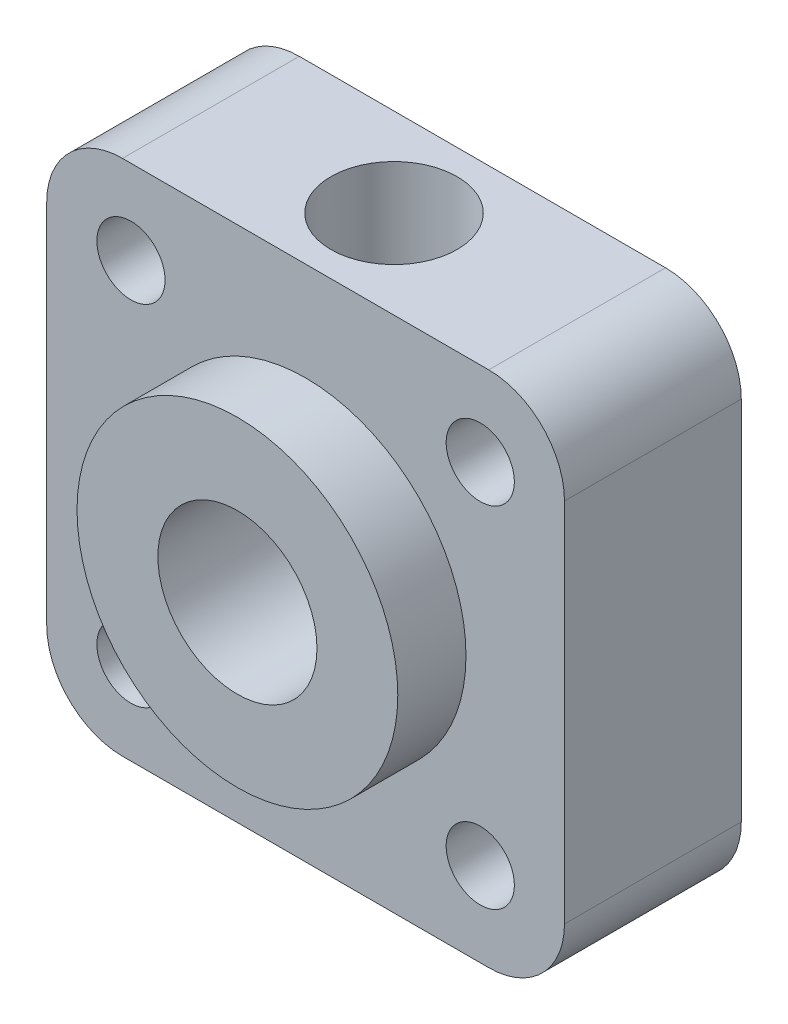
ISO-10303-21;
HEADER;
FILE_DESCRIPTION(('STEP AP214'),'2;1');
FILE_NAME('part.step','',(''),(''),'','','');
FILE_SCHEMA(('AUTOMOTIVE_DESIGN { 1 0 10303 214 1 1 1 1 }'));
ENDSEC;
DATA;
#1=APPLICATION_CONTEXT('core data for automotive mechanical design processes');
#2=APPLICATION_PROTOCOL_DEFINITION('international standard','automotive_design',2000,#1);
#3=PRODUCT_CONTEXT('',#1,'mechanical');
#4=PRODUCT('Part','Part','',(#3));
#5=PRODUCT_RELATED_PRODUCT_CATEGORY('part','',(#4));
#6=PRODUCT_DEFINITION_FORMATION('','',#4);
#7=PRODUCT_DEFINITION_CONTEXT('part definition',#1,'design');
#8=PRODUCT_DEFINITION('design','',#6,#7);
#9=PRODUCT_DEFINITION_SHAPE('','',#8);
#10=(LENGTH_UNIT() NAMED_UNIT(*) SI_UNIT(.MILLI.,.METRE.));
#11=(NAMED_UNIT(*) PLANE_ANGLE_UNIT() SI_UNIT($,.RADIAN.));
#12=(NAMED_UNIT(*) SI_UNIT($,.STERADIAN.) SOLID_ANGLE_UNIT());
#13=UNCERTAINTY_MEASURE_WITH_UNIT(LENGTH_MEASURE(1.E-05),#10,'distance_accuracy_value','');
#14=(GEOMETRIC_REPRESENTATION_CONTEXT(3) GLOBAL_UNCERTAINTY_ASSIGNED_CONTEXT((#13)) GLOBAL_UNIT_ASSIGNED_CONTEXT((#10,
#11,#12)) REPRESENTATION_CONTEXT('',''));
#15=CARTESIAN_POINT('',(0.,0.,0.));
#16=DIRECTION('',(0.,0.,1.));
#17=DIRECTION('',(1.,0.,0.));
#18=AXIS2_PLACEMENT_3D('',#15,#16,#17);
#19=CARTESIAN_POINT('',(0.,0.,7.));
#20=DIRECTION('',(0.,0.,1.));
#21=DIRECTION('',(1.,0.,0.));
#22=AXIS2_PLACEMENT_3D('',#19,#20,#21);
#23=PLANE('',#22);
#24=CARTESIAN_POINT('',(-6.91550432000444,-6.91550432000443,7.));
#25=DIRECTION('',(0.,0.,1.));
#26=DIRECTION('',(1.,0.,0.));
#27=AXIS2_PLACEMENT_3D('',#24,#25,#26);
#28=CIRCLE('',#27,1.35);
#29=CARTESIAN_POINT('',(-5.56550432000444,-6.91550432000443,7.));
#30=VERTEX_POINT('',#29);
#31=EDGE_CURVE('E202',#30,#30,#28,.T.);
#32=ORIENTED_EDGE('',*,*,#31,.F.);
#33=EDGE_LOOP('',(#32));
#34=FACE_BOUND('',#33,.T.);
#35=CARTESIAN_POINT('',(6.91550432000443,-6.91550432000443,7.));
#36=DIRECTION('',(0.,0.,1.));
#37=DIRECTION('',(1.,0.,0.));
#38=AXIS2_PLACEMENT_3D('',#35,#36,#37);
#39=CIRCLE('',#38,1.35);
#40=CARTESIAN_POINT('',(8.26550432000443,-6.91550432000443,7.));
#41=VERTEX_POINT('',#40);
#42=EDGE_CURVE('E196',#41,#41,#39,.T.);
#43=ORIENTED_EDGE('',*,*,#42,.F.);
#44=EDGE_LOOP('',(#43));
#45=FACE_BOUND('',#44,.T.);
#46=CARTESIAN_POINT('',(6.91550432000443,6.91550432000444,7.));
#47=DIRECTION('',(0.,0.,1.));
#48=DIRECTION('',(1.,0.,0.));
#49=AXIS2_PLACEMENT_3D('',#46,#47,#48);
#50=CIRCLE('',#49,1.35);
#51=CARTESIAN_POINT('',(8.26550432000443,6.91550432000444,7.));
#52=VERTEX_POINT('',#51);
#53=EDGE_CURVE('E190',#52,#52,#50,.T.);
#54=ORIENTED_EDGE('',*,*,#53,.F.);
#55=EDGE_LOOP('',(#54));
#56=FACE_BOUND('',#55,.T.);
#57=CARTESIAN_POINT('',(-6.91550432000444,6.91550432000443,7.));
#58=DIRECTION('',(0.,0.,1.));
#59=DIRECTION('',(1.,0.,0.));
#60=AXIS2_PLACEMENT_3D('',#57,#58,#59);
#61=CIRCLE('',#60,1.35000000000001);
#62=CARTESIAN_POINT('',(-5.56550432000443,6.91550432000443,7.));
#63=VERTEX_POINT('',#62);
#64=EDGE_CURVE('E184',#63,#63,#61,.T.);
#65=ORIENTED_EDGE('',*,*,#64,.F.);
#66=EDGE_LOOP('',(#65));
#67=FACE_BOUND('',#66,.T.);
#68=DIRECTION('',(0.,-1.,0.));
#69=VECTOR('',#68,1.);
#70=CARTESIAN_POINT('',(-10.25,10.25,7.));
#71=LINE('',#70,#69);
#72=CARTESIAN_POINT('',(-10.25,7.25000000000001,7.));
#73=VERTEX_POINT('',#72);
#74=CARTESIAN_POINT('',(-10.25,-7.24999999999999,7.));
#75=VERTEX_POINT('',#74);
#76=EDGE_CURVE('E171',#73,#75,#71,.T.);
#77=ORIENTED_EDGE('',*,*,#76,.T.);
#78=CARTESIAN_POINT('',(-7.25000000000001,-7.25,7.));
#79=DIRECTION('',(0.,0.,1.));
#80=DIRECTION('',(1.,0.,0.));
#81=AXIS2_PLACEMENT_3D('',#78,#79,#80);
#82=CIRCLE('',#81,3.);
#83=CARTESIAN_POINT('',(-7.25000000000001,-10.25,7.));
#84=VERTEX_POINT('',#83);
#85=EDGE_CURVE('E148',#75,#84,#82,.T.);
#86=ORIENTED_EDGE('',*,*,#85,.T.);
#87=DIRECTION('',(1.,0.,0.));
#88=VECTOR('',#87,1.);
#89=CARTESIAN_POINT('',(-10.25,-10.25,7.));
#90=LINE('',#89,#88);
#91=CARTESIAN_POINT('',(7.24999999999999,-10.25,7.));
#92=VERTEX_POINT('',#91);
#93=EDGE_CURVE('E120',#84,#92,#90,.T.);
#94=ORIENTED_EDGE('',*,*,#93,.T.);
#95=CARTESIAN_POINT('',(7.25,-7.24999999999999,7.));
#96=DIRECTION('',(0.,0.,1.));
#97=DIRECTION('',(1.,0.,0.));
#98=AXIS2_PLACEMENT_3D('',#95,#96,#97);
#99=CIRCLE('',#98,3.);
#100=CARTESIAN_POINT('',(10.25,-7.24999999999999,7.));
#101=VERTEX_POINT('',#100);
#102=EDGE_CURVE('E146',#92,#101,#99,.T.);
#103=ORIENTED_EDGE('',*,*,#102,.T.);
#104=DIRECTION('',(0.,1.,0.));
#105=VECTOR('',#104,1.);
#106=CARTESIAN_POINT('',(10.25,10.25,7.));
#107=LINE('',#106,#105);
#108=CARTESIAN_POINT('',(10.25,7.25000000000001,7.));
#109=VERTEX_POINT('',#108);
#110=EDGE_CURVE('E126',#101,#109,#107,.T.);
#111=ORIENTED_EDGE('',*,*,#110,.T.);
#112=CARTESIAN_POINT('',(7.24999999999999,7.25000000000001,7.));
#113=DIRECTION('',(0.,0.,1.));
#114=DIRECTION('',(1.,0.,0.));
#115=AXIS2_PLACEMENT_3D('',#112,#113,#114);
#116=CIRCLE('',#115,3.);
#117=CARTESIAN_POINT('',(7.24999999999999,10.25,7.));
#118=VERTEX_POINT('',#117);
#119=EDGE_CURVE('E55',#109,#118,#116,.T.);
#120=ORIENTED_EDGE('',*,*,#119,.T.);
#121=DIRECTION('',(-1.,0.,0.));
#122=VECTOR('',#121,1.);
#123=CARTESIAN_POINT('',(-10.25,10.25,7.));
#124=LINE('',#123,#122);
#125=CARTESIAN_POINT('',(-7.25000000000001,10.25,7.));
#126=VERTEX_POINT('',#125);
#127=EDGE_CURVE('E129',#118,#126,#124,.T.);
#128=ORIENTED_EDGE('',*,*,#127,.T.);
#129=CARTESIAN_POINT('',(-7.25000000000001,7.25000000000001,7.));
#130=DIRECTION('',(0.,0.,1.));
#131=DIRECTION('',(1.,0.,0.));
#132=AXIS2_PLACEMENT_3D('',#129,#130,#131);
#133=CIRCLE('',#132,3.);
#134=EDGE_CURVE('E143',#126,#73,#133,.T.);
#135=ORIENTED_EDGE('',*,*,#134,.T.);
#136=EDGE_LOOP('',(#77,#86,#94,#103,#111,#120,#128,#135));
#137=FACE_BOUND('',#136,.T.);
#138=CARTESIAN_POINT('',(0.,0.,7.));
#139=DIRECTION('',(0.,0.,1.));
#140=DIRECTION('',(1.,0.,0.));
#141=AXIS2_PLACEMENT_3D('',#138,#139,#140);
#142=CIRCLE('',#141,6.35);
#143=CARTESIAN_POINT('',(6.35,0.,7.));
#144=VERTEX_POINT('',#143);
#145=EDGE_CURVE('E167',#144,#144,#142,.T.);
#146=ORIENTED_EDGE('',*,*,#145,.F.);
#147=EDGE_LOOP('',(#146));
#148=FACE_BOUND('',#147,.T.);
#149=ADVANCED_FACE('F34',(#34,#45,#56,#67,#137,#148),#23,.T.);
#150=CARTESIAN_POINT('',(10.25,10.25,7.));
#151=DIRECTION('',(-1.,0.,0.));
#152=DIRECTION('',(0.,-1.,0.));
#153=AXIS2_PLACEMENT_3D('',#150,#151,#152);
#154=PLANE('',#153);
#155=ORIENTED_EDGE('',*,*,#110,.F.);
#156=DIRECTION('',(0.,0.,-1.));
#157=VECTOR('',#156,1.);
#158=CARTESIAN_POINT('',(10.25,-7.24999999999999,7.));
#159=LINE('',#158,#157);
#160=CARTESIAN_POINT('',(10.25,-7.24999999999999,0.));
#161=VERTEX_POINT('',#160);
#162=EDGE_CURVE('E152',#101,#161,#159,.T.);
#163=ORIENTED_EDGE('',*,*,#162,.T.);
#164=DIRECTION('',(0.,1.,0.));
#165=VECTOR('',#164,1.);
#166=CARTESIAN_POINT('',(10.25,10.25,0.));
#167=LINE('',#166,#165);
#168=CARTESIAN_POINT('',(10.25,7.25000000000001,0.));
#169=VERTEX_POINT('',#168);
#170=EDGE_CURVE('E159',#161,#169,#167,.T.);
#171=ORIENTED_EDGE('',*,*,#170,.T.);
#172=DIRECTION('',(0.,0.,-1.));
#173=VECTOR('',#172,1.);
#174=CARTESIAN_POINT('',(10.25,7.25000000000001,7.));
#175=LINE('',#174,#173);
#176=EDGE_CURVE('E150',#169,#109,#175,.F.);
#177=ORIENTED_EDGE('',*,*,#176,.T.);
#178=EDGE_LOOP('',(#155,#163,#171,#177));
#179=FACE_BOUND('',#178,.T.);
#180=ADVANCED_FACE('F158',(#179),#154,.F.);
#181=CARTESIAN_POINT('',(-10.25,10.25,7.));
#182=DIRECTION('',(0.,-1.,0.));
#183=DIRECTION('',(0.,0.,-1.));
#184=AXIS2_PLACEMENT_3D('',#181,#182,#183);
#185=PLANE('',#184);
#186=CARTESIAN_POINT('',(0.,10.25,3.5));
#187=DIRECTION('',(0.,1.,0.));
#188=DIRECTION('',(0.,0.,1.));
#189=AXIS2_PLACEMENT_3D('',#186,#187,#188);
#190=CIRCLE('',#189,2.5);
#191=CARTESIAN_POINT('',(0.,10.25,6.));
#192=VERTEX_POINT('',#191);
#193=EDGE_CURVE('E205',#192,#192,#190,.T.);
#194=ORIENTED_EDGE('',*,*,#193,.F.);
#195=EDGE_LOOP('',(#194));
#196=FACE_BOUND('',#195,.T.);
#197=ORIENTED_EDGE('',*,*,#127,.F.);
#198=DIRECTION('',(0.,0.,-1.));
#199=VECTOR('',#198,1.);
#200=CARTESIAN_POINT('',(7.24999999999999,10.25,7.));
#201=LINE('',#200,#199);
#202=CARTESIAN_POINT('',(7.24999999999999,10.25,0.));
#203=VERTEX_POINT('',#202);
#204=EDGE_CURVE('E11',#118,#203,#201,.T.);
#205=ORIENTED_EDGE('',*,*,#204,.T.);
#206=DIRECTION('',(-1.,0.,0.));
#207=VECTOR('',#206,1.);
#208=CARTESIAN_POINT('',(-10.25,10.25,0.));
#209=LINE('',#208,#207);
#210=CARTESIAN_POINT('',(-7.25000000000001,10.25,0.));
#211=VERTEX_POINT('',#210);
#212=EDGE_CURVE('E131',#203,#211,#209,.T.);
#213=ORIENTED_EDGE('',*,*,#212,.T.);
#214=DIRECTION('',(0.,0.,-1.));
#215=VECTOR('',#214,1.);
#216=CARTESIAN_POINT('',(-7.25000000000001,10.25,7.));
#217=LINE('',#216,#215);
#218=EDGE_CURVE('E42',#211,#126,#217,.F.);
#219=ORIENTED_EDGE('',*,*,#218,.T.);
#220=EDGE_LOOP('',(#197,#205,#213,#219));
#221=FACE_BOUND('',#220,.T.);
#222=ADVANCED_FACE('F261',(#196,#221),#185,.F.);
#223=CARTESIAN_POINT('',(-10.25,10.25,7.));
#224=DIRECTION('',(1.,0.,0.));
#225=DIRECTION('',(0.,1.,0.));
#226=AXIS2_PLACEMENT_3D('',#223,#224,#225);
#227=PLANE('',#226);
#228=DIRECTION('',(0.,-1.,0.));
#229=VECTOR('',#228,1.);
#230=CARTESIAN_POINT('',(-10.25,10.25,0.));
#231=LINE('',#230,#229);
#232=CARTESIAN_POINT('',(-10.25,7.25000000000001,0.));
#233=VERTEX_POINT('',#232);
#234=CARTESIAN_POINT('',(-10.25,-7.24999999999999,0.));
#235=VERTEX_POINT('',#234);
#236=EDGE_CURVE('E127',#233,#235,#231,.T.);
#237=ORIENTED_EDGE('',*,*,#236,.T.);
#238=DIRECTION('',(0.,0.,-1.));
#239=VECTOR('',#238,1.);
#240=CARTESIAN_POINT('',(-10.25,-7.25,7.));
#241=LINE('',#240,#239);
#242=EDGE_CURVE('E105',#235,#75,#241,.F.);
#243=ORIENTED_EDGE('',*,*,#242,.T.);
#244=ORIENTED_EDGE('',*,*,#76,.F.);
#245=DIRECTION('',(0.,0.,-1.));
#246=VECTOR('',#245,1.);
#247=CARTESIAN_POINT('',(-10.25,7.25000000000001,7.));
#248=LINE('',#247,#246);
#249=EDGE_CURVE('E110',#73,#233,#248,.T.);
#250=ORIENTED_EDGE('',*,*,#249,.T.);
#251=EDGE_LOOP('',(#237,#243,#244,#250));
#252=FACE_BOUND('',#251,.T.);
#253=ADVANCED_FACE('F258',(#252),#227,.F.);
#254=CARTESIAN_POINT('',(-10.25,-10.25,7.));
#255=DIRECTION('',(0.,1.,0.));
#256=DIRECTION('',(0.,0.,1.));
#257=AXIS2_PLACEMENT_3D('',#254,#255,#256);
#258=PLANE('',#257);
#259=ORIENTED_EDGE('',*,*,#93,.F.);
#260=DIRECTION('',(0.,0.,-1.));
#261=VECTOR('',#260,1.);
#262=CARTESIAN_POINT('',(-7.25000000000001,-10.25,7.));
#263=LINE('',#262,#261);
#264=CARTESIAN_POINT('',(-7.25000000000001,-10.25,0.));
#265=VERTEX_POINT('',#264);
#266=EDGE_CURVE('E104',#84,#265,#263,.T.);
#267=ORIENTED_EDGE('',*,*,#266,.T.);
#268=DIRECTION('',(1.,0.,0.));
#269=VECTOR('',#268,1.);
#270=CARTESIAN_POINT('',(-10.25,-10.25,0.));
#271=LINE('',#270,#269);
#272=CARTESIAN_POINT('',(7.24999999999999,-10.25,0.));
#273=VERTEX_POINT('',#272);
#274=EDGE_CURVE('E117',#265,#273,#271,.T.);
#275=ORIENTED_EDGE('',*,*,#274,.T.);
#276=DIRECTION('',(0.,0.,-1.));
#277=VECTOR('',#276,1.);
#278=CARTESIAN_POINT('',(7.25,-10.25,7.));
#279=LINE('',#278,#277);
#280=EDGE_CURVE('E122',#273,#92,#279,.F.);
#281=ORIENTED_EDGE('',*,*,#280,.T.);
#282=EDGE_LOOP('',(#259,#267,#275,#281));
#283=FACE_BOUND('',#282,.T.);
#284=ADVANCED_FACE('F116',(#283),#258,.F.);
#285=CARTESIAN_POINT('',(0.,0.,0.));
#286=DIRECTION('',(0.,0.,1.));
#287=DIRECTION('',(1.,0.,0.));
#288=AXIS2_PLACEMENT_3D('',#285,#286,#287);
#289=PLANE('',#288);
#290=CARTESIAN_POINT('',(-6.91550432000444,-6.91550432000443,0.));
#291=DIRECTION('',(0.,0.,1.));
#292=DIRECTION('',(1.,0.,0.));
#293=AXIS2_PLACEMENT_3D('',#290,#291,#292);
#294=CIRCLE('',#293,1.35);
#295=CARTESIAN_POINT('',(-5.56550432000444,-6.91550432000443,0.));
#296=VERTEX_POINT('',#295);
#297=EDGE_CURVE('E199',#296,#296,#294,.T.);
#298=ORIENTED_EDGE('',*,*,#297,.T.);
#299=EDGE_LOOP('',(#298));
#300=FACE_BOUND('',#299,.T.);
#301=CARTESIAN_POINT('',(6.91550432000443,-6.91550432000443,0.));
#302=DIRECTION('',(0.,0.,1.));
#303=DIRECTION('',(1.,0.,0.));
#304=AXIS2_PLACEMENT_3D('',#301,#302,#303);
#305=CIRCLE('',#304,1.35);
#306=CARTESIAN_POINT('',(8.26550432000443,-6.91550432000443,0.));
#307=VERTEX_POINT('',#306);
#308=EDGE_CURVE('E193',#307,#307,#305,.T.);
#309=ORIENTED_EDGE('',*,*,#308,.T.);
#310=EDGE_LOOP('',(#309));
#311=FACE_BOUND('',#310,.T.);
#312=CARTESIAN_POINT('',(6.91550432000443,6.91550432000444,0.));
#313=DIRECTION('',(0.,0.,1.));
#314=DIRECTION('',(1.,0.,0.));
#315=AXIS2_PLACEMENT_3D('',#312,#313,#314);
#316=CIRCLE('',#315,1.35);
#317=CARTESIAN_POINT('',(8.26550432000443,6.91550432000444,0.));
#318=VERTEX_POINT('',#317);
#319=EDGE_CURVE('E187',#318,#318,#316,.T.);
#320=ORIENTED_EDGE('',*,*,#319,.T.);
#321=EDGE_LOOP('',(#320));
#322=FACE_BOUND('',#321,.T.);
#323=CARTESIAN_POINT('',(-6.91550432000444,6.91550432000443,0.));
#324=DIRECTION('',(0.,0.,1.));
#325=DIRECTION('',(1.,0.,0.));
#326=AXIS2_PLACEMENT_3D('',#323,#324,#325);
#327=CIRCLE('',#326,1.35000000000001);
#328=CARTESIAN_POINT('',(-5.56550432000443,6.91550432000443,0.));
#329=VERTEX_POINT('',#328);
#330=EDGE_CURVE('E181',#329,#329,#327,.T.);
#331=ORIENTED_EDGE('',*,*,#330,.T.);
#332=EDGE_LOOP('',(#331));
#333=FACE_BOUND('',#332,.T.);
#334=CARTESIAN_POINT('',(0.,0.,0.));
#335=DIRECTION('',(0.,0.,1.));
#336=DIRECTION('',(1.,0.,0.));
#337=AXIS2_PLACEMENT_3D('',#334,#335,#336);
#338=CIRCLE('',#337,3.15);
#339=CARTESIAN_POINT('',(3.15,0.,0.));
#340=VERTEX_POINT('',#339);
#341=EDGE_CURVE('E176',#340,#340,#338,.T.);
#342=ORIENTED_EDGE('',*,*,#341,.T.);
#343=EDGE_LOOP('',(#342));
#344=FACE_BOUND('',#343,.T.);
#345=ORIENTED_EDGE('',*,*,#274,.F.);
#346=CARTESIAN_POINT('',(-7.25000000000001,-7.25,0.));
#347=DIRECTION('',(0.,0.,1.));
#348=DIRECTION('',(1.,0.,0.));
#349=AXIS2_PLACEMENT_3D('',#346,#347,#348);
#350=CIRCLE('',#349,3.);
#351=EDGE_CURVE('E100',#265,#235,#350,.F.);
#352=ORIENTED_EDGE('',*,*,#351,.T.);
#353=ORIENTED_EDGE('',*,*,#236,.F.);
#354=CARTESIAN_POINT('',(-7.25000000000001,7.25000000000001,0.));
#355=DIRECTION('',(0.,0.,1.));
#356=DIRECTION('',(1.,0.,0.));
#357=AXIS2_PLACEMENT_3D('',#354,#355,#356);
#358=CIRCLE('',#357,3.);
#359=EDGE_CURVE('E121',#233,#211,#358,.F.);
#360=ORIENTED_EDGE('',*,*,#359,.T.);
#361=ORIENTED_EDGE('',*,*,#212,.F.);
#362=CARTESIAN_POINT('',(7.24999999999999,7.25000000000001,0.));
#363=DIRECTION('',(0.,0.,1.));
#364=DIRECTION('',(1.,0.,0.));
#365=AXIS2_PLACEMENT_3D('',#362,#363,#364);
#366=CIRCLE('',#365,3.);
#367=EDGE_CURVE('E137',#203,#169,#366,.F.);
#368=ORIENTED_EDGE('',*,*,#367,.T.);
#369=ORIENTED_EDGE('',*,*,#170,.F.);
#370=CARTESIAN_POINT('',(7.25,-7.24999999999999,0.));
#371=DIRECTION('',(0.,0.,1.));
#372=DIRECTION('',(1.,0.,0.));
#373=AXIS2_PLACEMENT_3D('',#370,#371,#372);
#374=CIRCLE('',#373,3.);
#375=EDGE_CURVE('E111',#161,#273,#374,.F.);
#376=ORIENTED_EDGE('',*,*,#375,.T.);
#377=EDGE_LOOP('',(#345,#352,#353,#360,#361,#368,#369,#376));
#378=FACE_BOUND('',#377,.T.);
#379=ADVANCED_FACE('F124',(#300,#311,#322,#333,#344,#378),#289,.F.);
#380=CARTESIAN_POINT('',(-7.25000000000001,-7.25,7.));
#381=DIRECTION('',(0.,0.,-1.));
#382=DIRECTION('',(-1.,0.,0.));
#383=AXIS2_PLACEMENT_3D('',#380,#381,#382);
#384=CYLINDRICAL_SURFACE('',#383,3.);
#385=ORIENTED_EDGE('',*,*,#85,.F.);
#386=ORIENTED_EDGE('',*,*,#242,.F.);
#387=ORIENTED_EDGE('',*,*,#351,.F.);
#388=ORIENTED_EDGE('',*,*,#266,.F.);
#389=EDGE_LOOP('',(#385,#386,#387,#388));
#390=FACE_BOUND('',#389,.T.);
#391=ADVANCED_FACE('F103',(#390),#384,.T.);
#392=CARTESIAN_POINT('',(7.25,-7.24999999999999,7.));
#393=DIRECTION('',(0.,0.,-1.));
#394=DIRECTION('',(-1.,0.,0.));
#395=AXIS2_PLACEMENT_3D('',#392,#393,#394);
#396=CYLINDRICAL_SURFACE('',#395,3.);
#397=ORIENTED_EDGE('',*,*,#102,.F.);
#398=ORIENTED_EDGE('',*,*,#280,.F.);
#399=ORIENTED_EDGE('',*,*,#375,.F.);
#400=ORIENTED_EDGE('',*,*,#162,.F.);
#401=EDGE_LOOP('',(#397,#398,#399,#400));
#402=FACE_BOUND('',#401,.T.);
#403=ADVANCED_FACE('F270',(#402),#396,.T.);
#404=CARTESIAN_POINT('',(7.24999999999999,7.25000000000001,7.));
#405=DIRECTION('',(0.,0.,-1.));
#406=DIRECTION('',(-1.,0.,0.));
#407=AXIS2_PLACEMENT_3D('',#404,#405,#406);
#408=CYLINDRICAL_SURFACE('',#407,3.);
#409=ORIENTED_EDGE('',*,*,#119,.F.);
#410=ORIENTED_EDGE('',*,*,#176,.F.);
#411=ORIENTED_EDGE('',*,*,#367,.F.);
#412=ORIENTED_EDGE('',*,*,#204,.F.);
#413=EDGE_LOOP('',(#409,#410,#411,#412));
#414=FACE_BOUND('',#413,.T.);
#415=ADVANCED_FACE('F272',(#414),#408,.T.);
#416=CARTESIAN_POINT('',(-7.25000000000001,7.25000000000001,7.));
#417=DIRECTION('',(0.,0.,-1.));
#418=DIRECTION('',(-1.,0.,0.));
#419=AXIS2_PLACEMENT_3D('',#416,#417,#418);
#420=CYLINDRICAL_SURFACE('',#419,3.);
#421=ORIENTED_EDGE('',*,*,#134,.F.);
#422=ORIENTED_EDGE('',*,*,#218,.F.);
#423=ORIENTED_EDGE('',*,*,#359,.F.);
#424=ORIENTED_EDGE('',*,*,#249,.F.);
#425=EDGE_LOOP('',(#421,#422,#423,#424));
#426=FACE_BOUND('',#425,.T.);
#427=ADVANCED_FACE('F36',(#426),#420,.T.);
#428=CARTESIAN_POINT('',(0.,0.,9.7));
#429=DIRECTION('',(0.,0.,-1.));
#430=DIRECTION('',(-1.,0.,0.));
#431=AXIS2_PLACEMENT_3D('',#428,#429,#430);
#432=CYLINDRICAL_SURFACE('',#431,6.35);
#433=CARTESIAN_POINT('',(0.,0.,9.7));
#434=DIRECTION('',(0.,0.,1.));
#435=DIRECTION('',(1.,0.,0.));
#436=AXIS2_PLACEMENT_3D('',#433,#434,#435);
#437=CIRCLE('',#436,6.35);
#438=CARTESIAN_POINT('',(6.35,0.,9.7));
#439=VERTEX_POINT('',#438);
#440=EDGE_CURVE('E164',#439,#439,#437,.T.);
#441=ORIENTED_EDGE('',*,*,#440,.F.);
#442=EDGE_LOOP('',(#441));
#443=FACE_BOUND('',#442,.T.);
#444=ORIENTED_EDGE('',*,*,#145,.T.);
#445=EDGE_LOOP('',(#444));
#446=FACE_BOUND('',#445,.T.);
#447=ADVANCED_FACE('F245',(#443,#446),#432,.T.);
#448=CARTESIAN_POINT('',(0.,0.,9.7));
#449=DIRECTION('',(0.,0.,1.));
#450=DIRECTION('',(1.,0.,0.));
#451=AXIS2_PLACEMENT_3D('',#448,#449,#450);
#452=PLANE('',#451);
#453=CARTESIAN_POINT('',(0.,0.,9.7));
#454=DIRECTION('',(0.,0.,1.));
#455=DIRECTION('',(1.,0.,0.));
#456=AXIS2_PLACEMENT_3D('',#453,#454,#455);
#457=CIRCLE('',#456,3.15);
#458=CARTESIAN_POINT('',(3.15,0.,9.7));
#459=VERTEX_POINT('',#458);
#460=EDGE_CURVE('E178',#459,#459,#457,.T.);
#461=ORIENTED_EDGE('',*,*,#460,.F.);
#462=EDGE_LOOP('',(#461));
#463=FACE_BOUND('',#462,.T.);
#464=ORIENTED_EDGE('',*,*,#440,.T.);
#465=EDGE_LOOP('',(#464));
#466=FACE_BOUND('',#465,.T.);
#467=ADVANCED_FACE('F241',(#463,#466),#452,.T.);
#468=CARTESIAN_POINT('',(0.,0.,0.));
#469=DIRECTION('',(0.,0.,1.));
#470=DIRECTION('',(1.,0.,0.));
#471=AXIS2_PLACEMENT_3D('',#468,#469,#470);
#472=CYLINDRICAL_SURFACE('',#471,3.15);
#473=CARTESIAN_POINT('',(0.,3.15,6.));
#474=CARTESIAN_POINT('',(-0.120291306378563,3.14999029999306,5.99998999557036));
#475=CARTESIAN_POINT('',(-0.240733512649069,3.14303973949847,5.99124755297863));
#476=CARTESIAN_POINT('',(-0.477737895085477,3.11585785427079,5.95686310323272));
#477=CARTESIAN_POINT('',(-0.594292051408628,3.09560067126685,5.93118819144613));
#478=CARTESIAN_POINT('',(-0.819464120133992,3.04372290235362,5.86477823454961));
#479=CARTESIAN_POINT('',(-0.928126596617524,3.01217326155507,5.82413716963431));
#480=CARTESIAN_POINT('',(-1.13625828245288,2.93999567722191,5.72979685210701));
#481=CARTESIAN_POINT('',(-1.23572683407351,2.89936708489076,5.67609666624492));
#482=CARTESIAN_POINT('',(-1.45697877584158,2.79629921825558,5.53707479905212));
#483=CARTESIAN_POINT('',(-1.57466019990156,2.73116590196616,5.44723086236809));
#484=CARTESIAN_POINT('',(-1.79092601079644,2.59451053895805,5.25044812895189));
#485=CARTESIAN_POINT('',(-1.88945401372508,2.52297050880321,5.14346050198983));
#486=CARTESIAN_POINT('',(-2.0229791151431,2.41524515697463,4.97069669754177));
#487=CARTESIAN_POINT('',(-2.06538124413218,2.37898477785336,4.91054634966963));
#488=CARTESIAN_POINT('',(-2.14498491453336,2.3074655642899,4.78626970132202));
#489=CARTESIAN_POINT('',(-2.18218484384191,2.27220704299747,4.72214217721153));
#490=CARTESIAN_POINT('',(-2.2510564896356,2.20399349951311,4.59007998484075));
#491=CARTESIAN_POINT('',(-2.28274343360827,2.17103228806134,4.52215651078397));
#492=CARTESIAN_POINT('',(-2.34034222194084,2.10881338990154,4.38233266637824));
#493=CARTESIAN_POINT('',(-2.36625896484245,2.07955257097851,4.31043573447962));
#494=CARTESIAN_POINT('',(-2.41547615159977,2.02228130535527,4.15078319220021));
#495=CARTESIAN_POINT('',(-2.43769113348049,1.99522328927332,4.06233297828839));
#496=CARTESIAN_POINT('',(-2.47249632280019,1.95193506265822,3.88109656231565));
#497=CARTESIAN_POINT('',(-2.48510988961425,1.93567858529717,3.78832147026246));
#498=CARTESIAN_POINT('',(-2.49981081356272,1.9166669244522,3.59970657626231));
#499=CARTESIAN_POINT('',(-2.50181147851146,1.91402294065306,3.50384794977503));
#500=CARTESIAN_POINT('',(-2.4948397130203,1.92309535933052,3.31318508982986));
#501=CARTESIAN_POINT('',(-2.48585698817302,1.93482523402344,3.21838192972018));
#502=CARTESIAN_POINT('',(-2.45539371765035,1.97337758431179,3.01722667111474));
#503=CARTESIAN_POINT('',(-2.43207388662601,2.00239652941717,2.91159552591722));
#504=CARTESIAN_POINT('',(-2.37344026349091,2.07154917681422,2.70745042152514));
#505=CARTESIAN_POINT('',(-2.338091663955,2.11171507190219,2.60895813466174));
#506=CARTESIAN_POINT('',(-2.26754522626546,2.18692967289648,2.44454427900124));
#507=CARTESIAN_POINT('',(-2.23476609276154,2.22053439008812,2.37688315756127));
#508=CARTESIAN_POINT('',(-2.16377499019165,2.28976896454652,2.24554742327946));
#509=CARTESIAN_POINT('',(-2.12556062894182,2.32539970935359,2.18187458365212));
#510=CARTESIAN_POINT('',(-2.00299146384352,2.43359004193077,1.99667668925358));
#511=CARTESIAN_POINT('',(-1.91072582974722,2.50743044223642,1.88100724503052));
#512=CARTESIAN_POINT('',(-1.70347111435796,2.65276260303708,1.66391067790396));
#513=CARTESIAN_POINT('',(-1.58800474707266,2.72416020540352,1.56287598289108));
#514=CARTESIAN_POINT('',(-1.33644575496327,2.85594641703113,1.38156116905925));
#515=CARTESIAN_POINT('',(-1.20041115499449,2.91636497545273,1.30122433134286));
#516=CARTESIAN_POINT('',(-0.952402413613642,3.00456170852216,1.18573353806636));
#517=CARTESIAN_POINT('',(-0.844931524923217,3.0367226000534,1.14423395339552));
#518=CARTESIAN_POINT('',(-0.622752955082951,3.08993246846114,1.07602731739074));
#519=CARTESIAN_POINT('',(-0.508050844367161,3.11098988436908,1.04930903098915));
#520=CARTESIAN_POINT('',(-0.273813388763481,3.14030506600937,1.01220045411876));
#521=CARTESIAN_POINT('',(-0.154257456884488,3.14850080300733,1.00188928787264));
#522=CARTESIAN_POINT('',(0.0852451833351861,3.15112119427078,0.998587003986038));
#523=CARTESIAN_POINT('',(0.205191840774586,3.14554757588615,1.00559371383786));
#524=CARTESIAN_POINT('',(0.432602275929876,3.122091001424,1.03524360533732));
#525=CARTESIAN_POINT('',(0.540328597524373,3.10516013486793,1.05667776477885));
#526=CARTESIAN_POINT('',(0.750132250596006,3.06125785339188,1.11272074002021));
#527=CARTESIAN_POINT('',(0.852207785802295,3.03428326658989,1.14733371786757));
#528=CARTESIAN_POINT('',(1.05566386590796,2.9698883804766,1.2309695628535));
#529=CARTESIAN_POINT('',(1.15651240253807,2.93187663105419,1.2808206619374));
#530=CARTESIAN_POINT('',(1.34841615290996,2.84872307258591,1.39190156391274));
#531=CARTESIAN_POINT('',(1.43947120316235,2.80358114454211,1.45313155671332));
#532=CARTESIAN_POINT('',(1.62772960219598,2.69938451252064,1.59810744741517));
#533=CARTESIAN_POINT('',(1.72277575245987,2.63932042868035,1.68391984766794));
#534=CARTESIAN_POINT('',(1.89819764407492,2.51611861010401,1.86810219992158));
#535=CARTESIAN_POINT('',(1.97852551180039,2.45297166265469,1.96651142203481));
#536=CARTESIAN_POINT('',(2.09493200339584,2.35310466647333,2.13357493811239));
#537=CARTESIAN_POINT('',(2.13592041541382,2.31584173991969,2.1985397715432));
#538=CARTESIAN_POINT('',(2.21215566325738,2.24313121671946,2.33280990485853));
#539=CARTESIAN_POINT('',(2.24739935764866,2.20768462052798,2.40211755107538));
#540=CARTESIAN_POINT('',(2.31163743405462,2.14032452980969,2.54479120149864));
#541=CARTESIAN_POINT('',(2.34065934540574,2.10839578850413,2.61813744397918));
#542=CARTESIAN_POINT('',(2.39210484246801,2.04984219688464,2.76911857444287));
#543=CARTESIAN_POINT('',(2.41453374352584,2.02321307958953,2.84674994740017));
#544=CARTESIAN_POINT('',(2.45341818879864,1.97591804792462,3.01172640351336));
#545=CARTESIAN_POINT('',(2.46933194287172,1.95581467236816,3.09936914097675));
#546=CARTESIAN_POINT('',(2.49170010704655,1.92724609416453,3.27760507139857));
#547=CARTESIAN_POINT('',(2.4981760015177,1.91875446124535,3.36819108179099));
#548=CARTESIAN_POINT('',(2.50115700445295,1.91486908868918,3.55014161915086));
#549=CARTESIAN_POINT('',(2.49762786510145,1.91952033772654,3.64150775025224));
#550=CARTESIAN_POINT('',(2.48085007117042,1.94114765912439,3.82191165296339));
#551=CARTESIAN_POINT('',(2.46758451505774,1.95814516292688,3.91094509653627));
#552=CARTESIAN_POINT('',(2.42640691521074,2.009086066874,4.11361588749095));
#553=CARTESIAN_POINT('',(2.39509058013373,2.04678569257978,4.22558533384457));
#554=CARTESIAN_POINT('',(2.31906328754405,2.13253880246344,4.4407740931906));
#555=CARTESIAN_POINT('',(2.27431060209914,2.18062440887055,4.54396484284558));
#556=CARTESIAN_POINT('',(2.18788761415326,2.26675986040665,4.71211367004266));
#557=CARTESIAN_POINT('',(2.14925201459138,2.30354670842681,4.77932196472175));
#558=CARTESIAN_POINT('',(2.06626154137719,2.37827403439132,4.90944084820488));
#559=CARTESIAN_POINT('',(2.0219044156906,2.41621496207208,4.97234972973262));
#560=CARTESIAN_POINT('',(1.88049272729741,2.52998484911929,5.15450166837447));
#561=CARTESIAN_POINT('',(1.77499227623456,2.60587236138026,5.26737389476113));
#562=CARTESIAN_POINT('',(1.56148419994048,2.73813486783028,5.45668195418508));
#563=CARTESIAN_POINT('',(1.45677659721591,2.79566129372837,5.53605652372244));
#564=CARTESIAN_POINT('',(1.23278067884636,2.90138020643701,5.6789502187268));
#565=CARTESIAN_POINT('',(1.11351236549209,2.94958526794875,5.74249073853906));
#566=CARTESIAN_POINT('',(0.88405218224751,3.02538321831036,5.84120742382573));
#567=CARTESIAN_POINT('',(0.775856252277947,3.05509886556212,5.8793882402933));
#568=CARTESIAN_POINT('',(0.552989169118227,3.10316145646546,5.94079538262329));
#569=CARTESIAN_POINT('',(0.438333332301741,3.12153415084272,5.96405558592336));
#570=CARTESIAN_POINT('',(0.268869806822724,3.13896343746775,5.98608229479606));
#571=CARTESIAN_POINT('',(0.215326598598685,3.14309192904584,5.99129114370027));
#572=CARTESIAN_POINT('',(0.107865760081353,3.14861266511146,5.99825259295798));
#573=CARTESIAN_POINT('',(0.0539480555068704,3.15000435024382,6.00000448677084));
#574=CARTESIAN_POINT('',(0.,3.15,6.));
#575=B_SPLINE_CURVE_WITH_KNOTS('',3,(#473,#474,#475,#476,#477,#478,#479,#480,#481,#482,#483,
#484,#485,#486,#487,#488,#489,#490,#491,#492,#493,#494,#495,#496,#497,#498,#499,#500,#501,#502,
#503,#504,#505,#506,#507,#508,#509,#510,#511,#512,#513,#514,#515,#516,#517,#518,#519,#520,#521,
#522,#523,#524,#525,#526,#527,#528,#529,#530,#531,#532,#533,#534,#535,#536,#537,#538,#539,#540,
#541,#542,#543,#544,#545,#546,#547,#548,#549,#550,#551,#552,#553,#554,#555,#556,#557,#558,#559,
#560,#561,#562,#563,#564,#565,#566,#567,#568,#569,#570,#571,#572,#573,#574),.UNSPECIFIED.,.T.,
.F.,(4,2,2,2,2,2,2,2,2,2,2,2,2,2,2,2,2,2,2,2,2,2,2,2,2,2,2,2,2,2,2,2,2,2,2,2,2,2,2,2,2,2,2,2,2,
2,2,2,2,2,4),(0.,0.360640375181982,0.721983651074258,1.08109551777773,1.44023305540598,
1.92297275581139,2.40711271368256,2.65302551287184,2.89901434961774,3.14431256151508,
3.38940172966225,3.67378116535179,3.95746650052047,4.24346560925422,4.52973298211978,
4.8638874585498,5.19901721215327,5.44576599237059,5.69262371109489,6.18646337029646,
6.69175376566189,7.19564440778753,7.55303736313129,7.91015829431882,8.26899629686253,
8.62778928587518,8.95974001559757,9.29179566688311,9.64671981474355,10.0016498866771,
10.4244922527706,10.8486864702595,11.1045458538305,11.3605446852175,11.6153862945232,
11.8700218810669,12.1428648267233,12.4150856965326,12.6882395182789,12.9618686350326,
13.3265228707436,13.692321501421,13.9494377721482,14.2066555563063,14.7203343936275,
15.1490625180986,15.5772081821878,15.9313301079491,16.2846451226056,16.4463515031923,
16.6080909302887),.UNSPECIFIED.);
#576=CARTESIAN_POINT('',(0.,3.15,6.));
#577=VERTEX_POINT('',#576);
#578=EDGE_CURVE('E210',#577,#577,#575,.T.);
#579=ORIENTED_EDGE('',*,*,#578,.F.);
#580=EDGE_LOOP('',(#579));
#581=FACE_BOUND('',#580,.T.);
#582=ORIENTED_EDGE('',*,*,#341,.F.);
#583=EDGE_LOOP('',(#582));
#584=FACE_BOUND('',#583,.T.);
#585=ORIENTED_EDGE('',*,*,#460,.T.);
#586=EDGE_LOOP('',(#585));
#587=FACE_BOUND('',#586,.T.);
#588=ADVANCED_FACE('F237',(#581,#584,#587),#472,.F.);
#589=CARTESIAN_POINT('',(-6.91550432000444,6.91550432000443,0.));
#590=DIRECTION('',(0.,0.,1.));
#591=DIRECTION('',(1.,0.,0.));
#592=AXIS2_PLACEMENT_3D('',#589,#590,#591);
#593=CYLINDRICAL_SURFACE('',#592,1.35000000000001);
#594=ORIENTED_EDGE('',*,*,#330,.F.);
#595=EDGE_LOOP('',(#594));
#596=FACE_BOUND('',#595,.T.);
#597=ORIENTED_EDGE('',*,*,#64,.T.);
#598=EDGE_LOOP('',(#597));
#599=FACE_BOUND('',#598,.T.);
#600=ADVANCED_FACE('F233',(#596,#599),#593,.F.);
#601=CARTESIAN_POINT('',(6.91550432000443,6.91550432000444,0.));
#602=DIRECTION('',(0.,0.,1.));
#603=DIRECTION('',(1.,0.,0.));
#604=AXIS2_PLACEMENT_3D('',#601,#602,#603);
#605=CYLINDRICAL_SURFACE('',#604,1.35);
#606=ORIENTED_EDGE('',*,*,#319,.F.);
#607=EDGE_LOOP('',(#606));
#608=FACE_BOUND('',#607,.T.);
#609=ORIENTED_EDGE('',*,*,#53,.T.);
#610=EDGE_LOOP('',(#609));
#611=FACE_BOUND('',#610,.T.);
#612=ADVANCED_FACE('F229',(#608,#611),#605,.F.);
#613=CARTESIAN_POINT('',(6.91550432000443,-6.91550432000443,0.));
#614=DIRECTION('',(0.,0.,1.));
#615=DIRECTION('',(1.,0.,0.));
#616=AXIS2_PLACEMENT_3D('',#613,#614,#615);
#617=CYLINDRICAL_SURFACE('',#616,1.35);
#618=ORIENTED_EDGE('',*,*,#308,.F.);
#619=EDGE_LOOP('',(#618));
#620=FACE_BOUND('',#619,.T.);
#621=ORIENTED_EDGE('',*,*,#42,.T.);
#622=EDGE_LOOP('',(#621));
#623=FACE_BOUND('',#622,.T.);
#624=ADVANCED_FACE('F225',(#620,#623),#617,.F.);
#625=CARTESIAN_POINT('',(-6.91550432000444,-6.91550432000443,0.));
#626=DIRECTION('',(0.,0.,1.));
#627=DIRECTION('',(1.,0.,0.));
#628=AXIS2_PLACEMENT_3D('',#625,#626,#627);
#629=CYLINDRICAL_SURFACE('',#628,1.35);
#630=ORIENTED_EDGE('',*,*,#297,.F.);
#631=EDGE_LOOP('',(#630));
#632=FACE_BOUND('',#631,.T.);
#633=ORIENTED_EDGE('',*,*,#31,.T.);
#634=EDGE_LOOP('',(#633));
#635=FACE_BOUND('',#634,.T.);
#636=ADVANCED_FACE('F221',(#632,#635),#629,.F.);
#637=CARTESIAN_POINT('',(0.,-10.251,3.5));
#638=DIRECTION('',(0.,1.,0.));
#639=DIRECTION('',(0.,0.,1.));
#640=AXIS2_PLACEMENT_3D('',#637,#638,#639);
#641=CYLINDRICAL_SURFACE('',#640,2.5);
#642=ORIENTED_EDGE('',*,*,#193,.T.);
#643=EDGE_LOOP('',(#642));
#644=FACE_BOUND('',#643,.T.);
#645=ORIENTED_EDGE('',*,*,#578,.T.);
#646=EDGE_LOOP('',(#645));
#647=FACE_BOUND('',#646,.T.);
#648=ADVANCED_FACE('F216',(#644,#647),#641,.F.);
#649=CLOSED_SHELL('',(#149,#180,#222,#253,#284,#379,#391,#403,#415,#427,#447,#467,#588,#600,
#612,#624,#636,#648));
#650=MANIFOLD_SOLID_BREP('B2',#649);
#651=ADVANCED_BREP_SHAPE_REPRESENTATION('',(#18,#650),#14);
#652=SHAPE_DEFINITION_REPRESENTATION(#9,#651);
ENDSEC;
END-ISO-10303-21;
